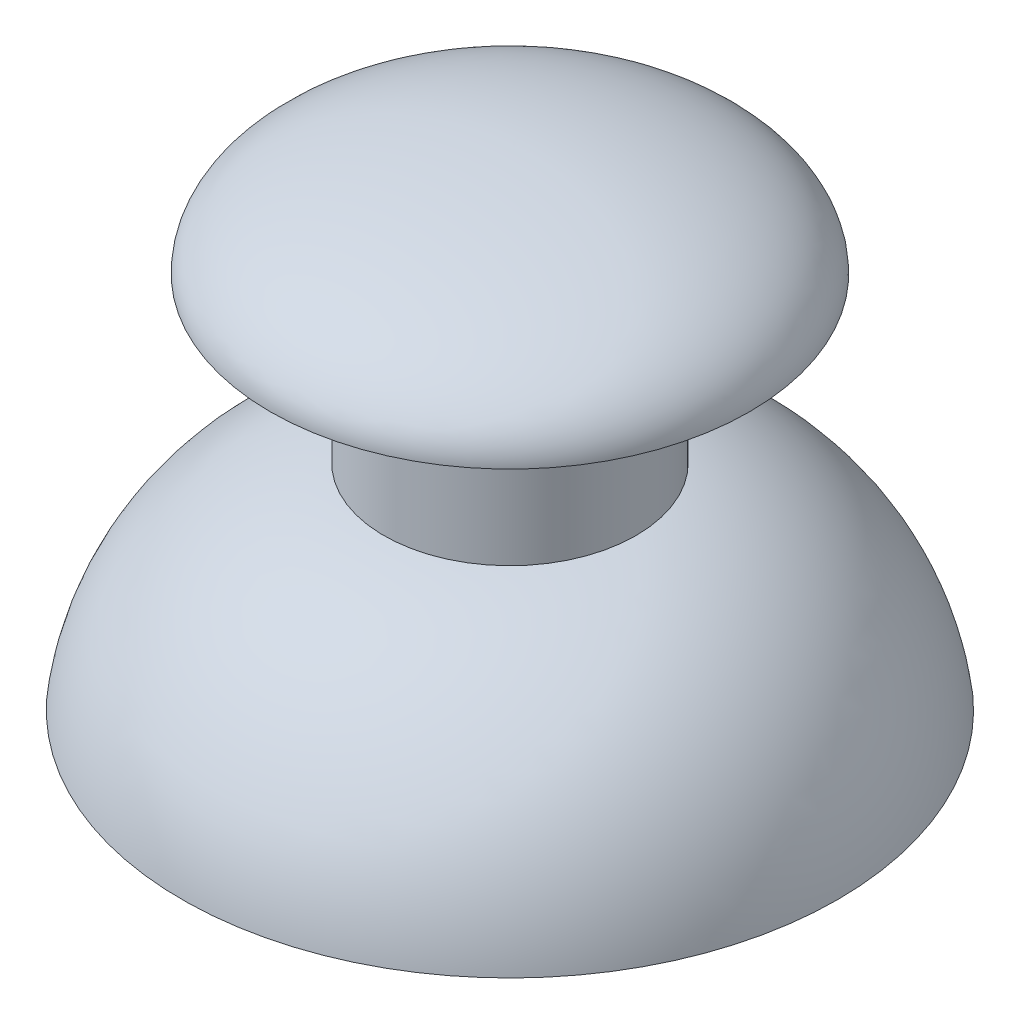
ISO-10303-21;
HEADER;
FILE_DESCRIPTION(('STEP AP214'),'2;1');
FILE_NAME('part.step','',(''),(''),'','','');
FILE_SCHEMA(('AUTOMOTIVE_DESIGN { 1 0 10303 214 1 1 1 1 }'));
ENDSEC;
DATA;
#1=APPLICATION_CONTEXT('core data for automotive mechanical design processes');
#2=APPLICATION_PROTOCOL_DEFINITION('international standard','automotive_design',2000,#1);
#3=PRODUCT_CONTEXT('',#1,'mechanical');
#4=PRODUCT('Part','Part','',(#3));
#5=PRODUCT_RELATED_PRODUCT_CATEGORY('part','',(#4));
#6=PRODUCT_DEFINITION_FORMATION('','',#4);
#7=PRODUCT_DEFINITION_CONTEXT('part definition',#1,'design');
#8=PRODUCT_DEFINITION('design','',#6,#7);
#9=PRODUCT_DEFINITION_SHAPE('','',#8);
#10=(LENGTH_UNIT() NAMED_UNIT(*) SI_UNIT(.MILLI.,.METRE.));
#11=(NAMED_UNIT(*) PLANE_ANGLE_UNIT() SI_UNIT($,.RADIAN.));
#12=(NAMED_UNIT(*) SI_UNIT($,.STERADIAN.) SOLID_ANGLE_UNIT());
#13=UNCERTAINTY_MEASURE_WITH_UNIT(LENGTH_MEASURE(1.E-05),#10,'distance_accuracy_value','');
#14=(GEOMETRIC_REPRESENTATION_CONTEXT(3) GLOBAL_UNCERTAINTY_ASSIGNED_CONTEXT((#13)) GLOBAL_UNIT_ASSIGNED_CONTEXT((#10,
#11,#12)) REPRESENTATION_CONTEXT('',''));
#15=CARTESIAN_POINT('',(0.,0.,0.));
#16=DIRECTION('',(0.,0.,1.));
#17=DIRECTION('',(1.,0.,0.));
#18=AXIS2_PLACEMENT_3D('',#15,#16,#17);
#19=CARTESIAN_POINT('',(0.,15.,0.));
#20=DIRECTION('',(0.,0.,1.));
#21=DIRECTION('',(-1.,0.,0.));
#22=AXIS2_PLACEMENT_3D('',#19,#20,#21);
#23=ELLIPSE('',#22,9.5,4.);
#24=TRIMMED_CURVE('',#23,(PARAMETER_VALUE(1.5707963267949)),(PARAMETER_VALUE(4.71238898038469)),
.T.,.PARAMETER.);
#25=CARTESIAN_POINT('',(0.,0.,0.));
#26=DIRECTION('',(0.,-1.,0.));
#27=AXIS1_PLACEMENT('',#25,#26);
#28=SURFACE_OF_REVOLUTION('',#24,#27);
#29=CARTESIAN_POINT('',(0.,19.,0.));
#30=VERTEX_POINT('',#29);
#31=VERTEX_LOOP('',#30);
#32=FACE_BOUND('',#31,.T.);
#33=CARTESIAN_POINT('',(0.,15.,0.));
#34=DIRECTION('',(0.,-1.,0.));
#35=DIRECTION('',(1.,0.,0.));
#36=AXIS2_PLACEMENT_3D('',#33,#34,#35);
#37=CIRCLE('',#36,9.49999999999999);
#38=CARTESIAN_POINT('',(9.5,15.,0.));
#39=VERTEX_POINT('',#38);
#40=EDGE_CURVE('E52',#39,#39,#37,.T.);
#41=ORIENTED_EDGE('',*,*,#40,.F.);
#42=EDGE_LOOP('',(#41));
#43=FACE_BOUND('',#42,.T.);
#44=ADVANCED_FACE('F37',(#32,#43),#28,.F.);
#45=CARTESIAN_POINT('',(0.,8.5,0.));
#46=DIRECTION('',(0.,-1.,0.));
#47=DIRECTION('',(1.,0.,0.));
#48=AXIS2_PLACEMENT_3D('',#45,#46,#47);
#49=PLANE('',#48);
#50=CARTESIAN_POINT('',(0.,8.5,0.));
#51=DIRECTION('',(0.,-1.,0.));
#52=DIRECTION('',(1.,0.,0.));
#53=AXIS2_PLACEMENT_3D('',#50,#51,#52);
#54=CIRCLE('',#53,0.999999999999997);
#55=CARTESIAN_POINT('',(0.999999999999998,8.5,0.));
#56=VERTEX_POINT('',#55);
#57=EDGE_CURVE('E11',#56,#56,#54,.T.);
#58=ORIENTED_EDGE('',*,*,#57,.T.);
#59=EDGE_LOOP('',(#58));
#60=FACE_BOUND('',#59,.T.);
#61=ADVANCED_FACE('F49',(#60),#49,.T.);
#62=CARTESIAN_POINT('',(0.,0.,0.));
#63=DIRECTION('',(0.,-1.,0.));
#64=DIRECTION('',(1.,0.,0.));
#65=AXIS2_PLACEMENT_3D('',#62,#63,#64);
#66=CYLINDRICAL_SURFACE('',#65,0.999999999999998);
#67=CARTESIAN_POINT('',(0.,3.,0.));
#68=DIRECTION('',(0.,-1.,0.));
#69=DIRECTION('',(1.,0.,0.));
#70=AXIS2_PLACEMENT_3D('',#67,#68,#69);
#71=CIRCLE('',#70,0.999999999999999);
#72=CARTESIAN_POINT('',(1.,3.,0.));
#73=VERTEX_POINT('',#72);
#74=EDGE_CURVE('E44',#73,#73,#71,.T.);
#75=ORIENTED_EDGE('',*,*,#74,.T.);
#76=EDGE_LOOP('',(#75));
#77=FACE_BOUND('',#76,.T.);
#78=ORIENTED_EDGE('',*,*,#57,.F.);
#79=EDGE_LOOP('',(#78));
#80=FACE_BOUND('',#79,.T.);
#81=ADVANCED_FACE('F83',(#77,#80),#66,.F.);
#82=CARTESIAN_POINT('',(1.,3.,0.));
#83=DIRECTION('',(0.,-1.,0.));
#84=DIRECTION('',(1.,0.,0.));
#85=AXIS2_PLACEMENT_3D('',#82,#83,#84);
#86=PLANE('',#85);
#87=CARTESIAN_POINT('',(0.,3.,0.));
#88=DIRECTION('',(0.,-1.,0.));
#89=DIRECTION('',(1.,0.,0.));
#90=AXIS2_PLACEMENT_3D('',#87,#88,#89);
#91=CIRCLE('',#90,3.);
#92=CARTESIAN_POINT('',(3.,3.,0.));
#93=VERTEX_POINT('',#92);
#94=EDGE_CURVE('E78',#93,#93,#91,.T.);
#95=ORIENTED_EDGE('',*,*,#94,.T.);
#96=EDGE_LOOP('',(#95));
#97=FACE_BOUND('',#96,.T.);
#98=ORIENTED_EDGE('',*,*,#74,.F.);
#99=EDGE_LOOP('',(#98));
#100=FACE_BOUND('',#99,.T.);
#101=ADVANCED_FACE('F86',(#97,#100),#86,.T.);
#102=CARTESIAN_POINT('',(0.,0.,0.));
#103=DIRECTION('',(0.,-1.,0.));
#104=DIRECTION('',(1.,0.,0.));
#105=AXIS2_PLACEMENT_3D('',#102,#103,#104);
#106=CYLINDRICAL_SURFACE('',#105,3.);
#107=CARTESIAN_POINT('',(0.,14.,0.));
#108=DIRECTION('',(0.,-1.,0.));
#109=DIRECTION('',(1.,0.,0.));
#110=AXIS2_PLACEMENT_3D('',#107,#108,#109);
#111=CIRCLE('',#110,2.99999999999999);
#112=CARTESIAN_POINT('',(3.,14.,0.));
#113=VERTEX_POINT('',#112);
#114=EDGE_CURVE('E75',#113,#113,#111,.T.);
#115=ORIENTED_EDGE('',*,*,#114,.T.);
#116=EDGE_LOOP('',(#115));
#117=FACE_BOUND('',#116,.T.);
#118=ORIENTED_EDGE('',*,*,#94,.F.);
#119=EDGE_LOOP('',(#118));
#120=FACE_BOUND('',#119,.T.);
#121=ADVANCED_FACE('F88',(#117,#120),#106,.T.);
#122=CARTESIAN_POINT('',(3.,14.,0.));
#123=DIRECTION('',(0.,-1.,0.));
#124=DIRECTION('',(1.,0.,0.));
#125=AXIS2_PLACEMENT_3D('',#122,#123,#124);
#126=PLANE('',#125);
#127=CARTESIAN_POINT('',(0.,14.,0.));
#128=DIRECTION('',(0.,-1.,0.));
#129=DIRECTION('',(1.,0.,0.));
#130=AXIS2_PLACEMENT_3D('',#127,#128,#129);
#131=CIRCLE('',#130,3.99999999999999);
#132=CARTESIAN_POINT('',(4.,14.,0.));
#133=VERTEX_POINT('',#132);
#134=EDGE_CURVE('E72',#133,#133,#131,.T.);
#135=ORIENTED_EDGE('',*,*,#134,.T.);
#136=EDGE_LOOP('',(#135));
#137=FACE_BOUND('',#136,.T.);
#138=ORIENTED_EDGE('',*,*,#114,.F.);
#139=EDGE_LOOP('',(#138));
#140=FACE_BOUND('',#139,.T.);
#141=ADVANCED_FACE('F95',(#137,#140),#126,.T.);
#142=CARTESIAN_POINT('',(0.,0.,0.));
#143=DIRECTION('',(0.,-1.,0.));
#144=DIRECTION('',(1.,0.,0.));
#145=AXIS2_PLACEMENT_3D('',#142,#143,#144);
#146=CYLINDRICAL_SURFACE('',#145,4.);
#147=CARTESIAN_POINT('',(0.,7.63826613312956,0.));
#148=DIRECTION('',(0.,-1.,0.));
#149=DIRECTION('',(1.,0.,0.));
#150=AXIS2_PLACEMENT_3D('',#147,#148,#149);
#151=CIRCLE('',#150,4.);
#152=CARTESIAN_POINT('',(4.,7.63826613312956,0.));
#153=VERTEX_POINT('',#152);
#154=EDGE_CURVE('E69',#153,#153,#151,.T.);
#155=ORIENTED_EDGE('',*,*,#154,.T.);
#156=EDGE_LOOP('',(#155));
#157=FACE_BOUND('',#156,.T.);
#158=ORIENTED_EDGE('',*,*,#134,.F.);
#159=EDGE_LOOP('',(#158));
#160=FACE_BOUND('',#159,.T.);
#161=ADVANCED_FACE('F131',(#157,#160),#146,.F.);
#162=CARTESIAN_POINT('',(0.,-1.31529218138816,0.));
#163=DIRECTION('',(0.,-1.,0.));
#164=DIRECTION('',(1.,0.,0.));
#165=AXIS2_PLACEMENT_3D('',#162,#163,#164);
#166=DEGENERATE_TOROIDAL_SURFACE('',#165,3.08687705727508,9.,.T.);
#167=CARTESIAN_POINT('',(0.,0.0320265790328077,0.));
#168=DIRECTION('',(0.,-1.,0.));
#169=DIRECTION('',(1.,0.,0.));
#170=AXIS2_PLACEMENT_3D('',#167,#168,#169);
#171=CIRCLE('',#170,11.9854574023536);
#172=CARTESIAN_POINT('',(11.9854574023536,0.032026579032806,0.));
#173=VERTEX_POINT('',#172);
#174=EDGE_CURVE('E66',#173,#173,#171,.T.);
#175=ORIENTED_EDGE('',*,*,#174,.T.);
#176=EDGE_LOOP('',(#175));
#177=FACE_BOUND('',#176,.T.);
#178=ORIENTED_EDGE('',*,*,#154,.F.);
#179=EDGE_LOOP('',(#178));
#180=FACE_BOUND('',#179,.T.);
#181=ADVANCED_FACE('F140',(#177,#180),#166,.F.);
#182=CARTESIAN_POINT('',(0.,0.0320265790328077,0.));
#183=DIRECTION('',(0.,-1.,0.));
#184=DIRECTION('',(1.,0.,0.));
#185=AXIS2_PLACEMENT_3D('',#182,#183,#184);
#186=CONICAL_SURFACE('',#185,11.9854574023536,1.53923930077926);
#187=CARTESIAN_POINT('',(0.,0.,0.));
#188=DIRECTION('',(0.,-1.,0.));
#189=DIRECTION('',(1.,0.,0.));
#190=AXIS2_PLACEMENT_3D('',#187,#188,#189);
#191=CIRCLE('',#190,13.);
#192=CARTESIAN_POINT('',(13.,0.,0.));
#193=VERTEX_POINT('',#192);
#194=EDGE_CURVE('E63',#193,#193,#191,.T.);
#195=ORIENTED_EDGE('',*,*,#194,.T.);
#196=EDGE_LOOP('',(#195));
#197=FACE_BOUND('',#196,.T.);
#198=ORIENTED_EDGE('',*,*,#174,.F.);
#199=EDGE_LOOP('',(#198));
#200=FACE_BOUND('',#199,.T.);
#201=ADVANCED_FACE('F150',(#197,#200),#186,.F.);
#202=CARTESIAN_POINT('',(0.,-1.31529218138816,0.));
#203=DIRECTION('',(0.,-1.,0.));
#204=DIRECTION('',(1.,0.,0.));
#205=AXIS2_PLACEMENT_3D('',#202,#203,#204);
#206=DEGENERATE_TOROIDAL_SURFACE('',#205,3.08687705727508,10.,.T.);
#207=CARTESIAN_POINT('',(0.,8.5,0.));
#208=DIRECTION('',(0.,-1.,0.));
#209=DIRECTION('',(1.,0.,0.));
#210=AXIS2_PLACEMENT_3D('',#207,#208,#209);
#211=CIRCLE('',#210,5.);
#212=CARTESIAN_POINT('',(5.,8.5,0.));
#213=VERTEX_POINT('',#212);
#214=EDGE_CURVE('E57',#213,#213,#211,.T.);
#215=ORIENTED_EDGE('',*,*,#214,.T.);
#216=EDGE_LOOP('',(#215));
#217=FACE_BOUND('',#216,.T.);
#218=ORIENTED_EDGE('',*,*,#194,.F.);
#219=EDGE_LOOP('',(#218));
#220=FACE_BOUND('',#219,.T.);
#221=ADVANCED_FACE('F160',(#217,#220),#206,.T.);
#222=CARTESIAN_POINT('',(0.,0.,0.));
#223=DIRECTION('',(0.,-1.,0.));
#224=DIRECTION('',(1.,0.,0.));
#225=AXIS2_PLACEMENT_3D('',#222,#223,#224);
#226=CYLINDRICAL_SURFACE('',#225,5.);
#227=CARTESIAN_POINT('',(0.,14.,0.));
#228=DIRECTION('',(0.,-1.,0.));
#229=DIRECTION('',(1.,0.,0.));
#230=AXIS2_PLACEMENT_3D('',#227,#228,#229);
#231=CIRCLE('',#230,4.99999999999999);
#232=CARTESIAN_POINT('',(5.,14.,0.));
#233=VERTEX_POINT('',#232);
#234=EDGE_CURVE('E54',#233,#233,#231,.T.);
#235=ORIENTED_EDGE('',*,*,#234,.T.);
#236=EDGE_LOOP('',(#235));
#237=FACE_BOUND('',#236,.T.);
#238=ORIENTED_EDGE('',*,*,#214,.F.);
#239=EDGE_LOOP('',(#238));
#240=FACE_BOUND('',#239,.T.);
#241=ADVANCED_FACE('F170',(#237,#240),#226,.T.);
#242=CARTESIAN_POINT('',(0.,14.,0.));
#243=DIRECTION('',(0.,1.,0.));
#244=DIRECTION('',(-1.,0.,0.));
#245=AXIS2_PLACEMENT_3D('',#242,#243,#244);
#246=CONICAL_SURFACE('',#245,4.99999999999999,1.35212738092095);
#247=ORIENTED_EDGE('',*,*,#40,.T.);
#248=EDGE_LOOP('',(#247));
#249=FACE_BOUND('',#248,.T.);
#250=ORIENTED_EDGE('',*,*,#234,.F.);
#251=EDGE_LOOP('',(#250));
#252=FACE_BOUND('',#251,.T.);
#253=ADVANCED_FACE('F180',(#249,#252),#246,.T.);
#254=CLOSED_SHELL('',(#44,#61,#81,#101,#121,#141,#161,#181,#201,#221,#241,#253));
#255=MANIFOLD_SOLID_BREP('B2',#254);
#256=ADVANCED_BREP_SHAPE_REPRESENTATION('',(#18,#255),#14);
#257=SHAPE_DEFINITION_REPRESENTATION(#9,#256);
ENDSEC;
END-ISO-10303-21;
